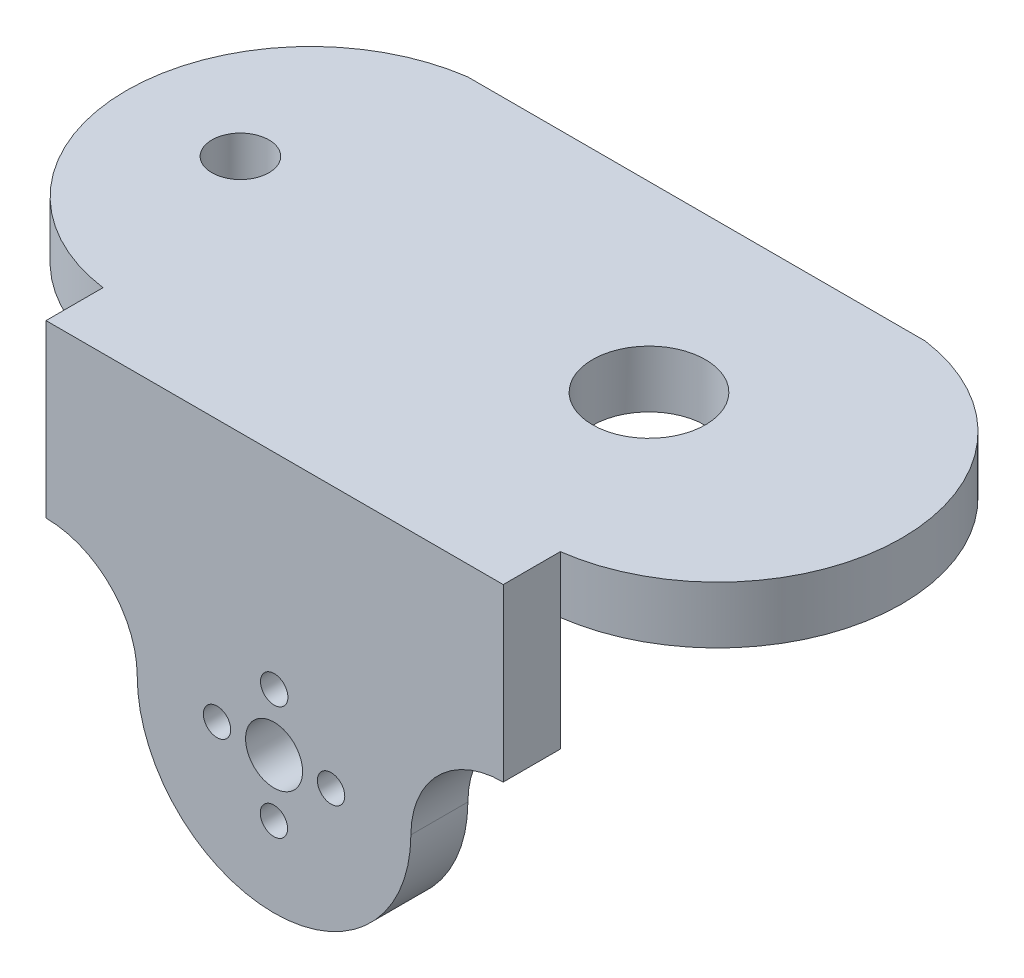
ISO-10303-21;
HEADER;
FILE_DESCRIPTION(('STEP AP214'),'2;1');
FILE_NAME('part.step','',(''),(''),'','','');
FILE_SCHEMA(('AUTOMOTIVE_DESIGN { 1 0 10303 214 1 1 1 1 }'));
ENDSEC;
DATA;
#1=APPLICATION_CONTEXT('core data for automotive mechanical design processes');
#2=APPLICATION_PROTOCOL_DEFINITION('international standard','automotive_design',2000,#1);
#3=PRODUCT_CONTEXT('',#1,'mechanical');
#4=PRODUCT('Part','Part','',(#3));
#5=PRODUCT_RELATED_PRODUCT_CATEGORY('part','',(#4));
#6=PRODUCT_DEFINITION_FORMATION('','',#4);
#7=PRODUCT_DEFINITION_CONTEXT('part definition',#1,'design');
#8=PRODUCT_DEFINITION('design','',#6,#7);
#9=PRODUCT_DEFINITION_SHAPE('','',#8);
#10=(LENGTH_UNIT() NAMED_UNIT(*) SI_UNIT(.MILLI.,.METRE.));
#11=(NAMED_UNIT(*) PLANE_ANGLE_UNIT() SI_UNIT($,.RADIAN.));
#12=(NAMED_UNIT(*) SI_UNIT($,.STERADIAN.) SOLID_ANGLE_UNIT());
#13=UNCERTAINTY_MEASURE_WITH_UNIT(LENGTH_MEASURE(1.E-05),#10,'distance_accuracy_value','');
#14=(GEOMETRIC_REPRESENTATION_CONTEXT(3) GLOBAL_UNCERTAINTY_ASSIGNED_CONTEXT((#13)) GLOBAL_UNIT_ASSIGNED_CONTEXT((#10,
#11,#12)) REPRESENTATION_CONTEXT('',''));
#15=CARTESIAN_POINT('',(0.,0.,0.));
#16=DIRECTION('',(0.,0.,1.));
#17=DIRECTION('',(1.,0.,0.));
#18=AXIS2_PLACEMENT_3D('',#15,#16,#17);
#19=CARTESIAN_POINT('',(40.1,0.,5.));
#20=DIRECTION('',(1.,0.,0.));
#21=DIRECTION('',(0.,0.,-1.));
#22=AXIS2_PLACEMENT_3D('',#19,#20,#21);
#23=PLANE('',#22);
#24=DIRECTION('',(0.,1.,0.));
#25=VECTOR('',#24,1.);
#26=CARTESIAN_POINT('',(40.1,-34.9084875066222,0.));
#27=LINE('',#26,#25);
#28=CARTESIAN_POINT('',(40.1,0.,0.));
#29=VERTEX_POINT('',#28);
#30=CARTESIAN_POINT('',(40.1,5.,0.));
#31=VERTEX_POINT('',#30);
#32=EDGE_CURVE('E56',#29,#31,#27,.T.);
#33=ORIENTED_EDGE('',*,*,#32,.T.);
#34=DIRECTION('',(0.,0.,1.));
#35=VECTOR('',#34,1.);
#36=CARTESIAN_POINT('',(40.1,5.,-32.));
#37=LINE('',#36,#35);
#38=CARTESIAN_POINT('',(40.1,5.,5.));
#39=VERTEX_POINT('',#38);
#40=EDGE_CURVE('E122',#31,#39,#37,.T.);
#41=ORIENTED_EDGE('',*,*,#40,.T.);
#42=DIRECTION('',(0.,-1.,0.));
#43=VECTOR('',#42,1.);
#44=CARTESIAN_POINT('',(40.1,0.,5.));
#45=LINE('',#44,#43);
#46=CARTESIAN_POINT('',(40.1,-10.,5.));
#47=VERTEX_POINT('',#46);
#48=EDGE_CURVE('E159',#39,#47,#45,.T.);
#49=ORIENTED_EDGE('',*,*,#48,.T.);
#50=DIRECTION('',(0.,0.,-1.));
#51=VECTOR('',#50,1.);
#52=CARTESIAN_POINT('',(40.1,-10.,5.));
#53=LINE('',#52,#51);
#54=CARTESIAN_POINT('',(40.1,-10.,0.));
#55=VERTEX_POINT('',#54);
#56=EDGE_CURVE('E171',#47,#55,#53,.T.);
#57=ORIENTED_EDGE('',*,*,#56,.T.);
#58=DIRECTION('',(0.,-1.,0.));
#59=VECTOR('',#58,1.);
#60=CARTESIAN_POINT('',(40.1,0.,0.));
#61=LINE('',#60,#59);
#62=EDGE_CURVE('E157',#29,#55,#61,.T.);
#63=ORIENTED_EDGE('',*,*,#62,.F.);
#64=EDGE_LOOP('',(#33,#41,#49,#57,#63));
#65=FACE_BOUND('',#64,.T.);
#66=ADVANCED_FACE('F40',(#65),#23,.T.);
#67=CARTESIAN_POINT('',(0.,0.,5.));
#68=DIRECTION('',(1.,0.,0.));
#69=DIRECTION('',(0.,1.,0.));
#70=AXIS2_PLACEMENT_3D('',#67,#68,#69);
#71=PLANE('',#70);
#72=DIRECTION('',(0.,0.,1.));
#73=VECTOR('',#72,1.);
#74=CARTESIAN_POINT('',(0.,5.,-32.));
#75=LINE('',#74,#73);
#76=CARTESIAN_POINT('',(0.,5.,0.));
#77=VERTEX_POINT('',#76);
#78=CARTESIAN_POINT('',(0.,5.,5.));
#79=VERTEX_POINT('',#78);
#80=EDGE_CURVE('E64',#77,#79,#75,.T.);
#81=ORIENTED_EDGE('',*,*,#80,.F.);
#82=DIRECTION('',(0.,1.,0.));
#83=VECTOR('',#82,1.);
#84=CARTESIAN_POINT('',(0.,-34.9084875066222,0.));
#85=LINE('',#84,#83);
#86=CARTESIAN_POINT('',(0.,0.,0.));
#87=VERTEX_POINT('',#86);
#88=EDGE_CURVE('E149',#87,#77,#85,.T.);
#89=ORIENTED_EDGE('',*,*,#88,.F.);
#90=DIRECTION('',(0.,-1.,0.));
#91=VECTOR('',#90,1.);
#92=CARTESIAN_POINT('',(0.,0.,0.));
#93=LINE('',#92,#91);
#94=CARTESIAN_POINT('',(0.,-10.,0.));
#95=VERTEX_POINT('',#94);
#96=EDGE_CURVE('E177',#87,#95,#93,.T.);
#97=ORIENTED_EDGE('',*,*,#96,.T.);
#98=DIRECTION('',(0.,0.,-1.));
#99=VECTOR('',#98,1.);
#100=CARTESIAN_POINT('',(0.,-10.,5.));
#101=LINE('',#100,#99);
#102=CARTESIAN_POINT('',(0.,-10.,5.));
#103=VERTEX_POINT('',#102);
#104=EDGE_CURVE('E11',#103,#95,#101,.T.);
#105=ORIENTED_EDGE('',*,*,#104,.F.);
#106=DIRECTION('',(0.,-1.,0.));
#107=VECTOR('',#106,1.);
#108=CARTESIAN_POINT('',(0.,0.,5.));
#109=LINE('',#108,#107);
#110=EDGE_CURVE('E162',#79,#103,#109,.T.);
#111=ORIENTED_EDGE('',*,*,#110,.F.);
#112=EDGE_LOOP('',(#81,#89,#97,#105,#111));
#113=FACE_BOUND('',#112,.T.);
#114=ADVANCED_FACE('F225',(#113),#71,.F.);
#115=CARTESIAN_POINT('',(0.,-18.,5.));
#116=DIRECTION('',(0.,0.,-1.));
#117=DIRECTION('',(-1.,0.,0.));
#118=AXIS2_PLACEMENT_3D('',#115,#116,#117);
#119=CYLINDRICAL_SURFACE('',#118,8.);
#120=CARTESIAN_POINT('',(0.,-18.,0.));
#121=DIRECTION('',(0.,0.,1.));
#122=DIRECTION('',(1.,0.,0.));
#123=AXIS2_PLACEMENT_3D('',#120,#121,#122);
#124=CIRCLE('',#123,8.);
#125=CARTESIAN_POINT('',(8.,-18.,0.));
#126=VERTEX_POINT('',#125);
#127=EDGE_CURVE('E179',#95,#126,#124,.F.);
#128=ORIENTED_EDGE('',*,*,#127,.T.);
#129=DIRECTION('',(0.,0.,-1.));
#130=VECTOR('',#129,1.);
#131=CARTESIAN_POINT('',(8.,-18.,5.));
#132=LINE('',#131,#130);
#133=CARTESIAN_POINT('',(8.,-18.,5.));
#134=VERTEX_POINT('',#133);
#135=EDGE_CURVE('E48',#134,#126,#132,.T.);
#136=ORIENTED_EDGE('',*,*,#135,.F.);
#137=CARTESIAN_POINT('',(0.,-18.,5.));
#138=DIRECTION('',(0.,0.,1.));
#139=DIRECTION('',(1.,0.,0.));
#140=AXIS2_PLACEMENT_3D('',#137,#138,#139);
#141=CIRCLE('',#140,8.);
#142=EDGE_CURVE('E165',#103,#134,#141,.F.);
#143=ORIENTED_EDGE('',*,*,#142,.F.);
#144=ORIENTED_EDGE('',*,*,#104,.T.);
#145=EDGE_LOOP('',(#128,#136,#143,#144));
#146=FACE_BOUND('',#145,.T.);
#147=ADVANCED_FACE('F230',(#146),#119,.F.);
#148=CARTESIAN_POINT('',(20.,-18.,5.));
#149=DIRECTION('',(0.,0.,-1.));
#150=DIRECTION('',(-1.,0.,0.));
#151=AXIS2_PLACEMENT_3D('',#148,#149,#150);
#152=CYLINDRICAL_SURFACE('',#151,12.);
#153=CARTESIAN_POINT('',(20.,-18.,0.));
#154=DIRECTION('',(0.,0.,1.));
#155=DIRECTION('',(1.,0.,0.));
#156=AXIS2_PLACEMENT_3D('',#153,#154,#155);
#157=CIRCLE('',#156,12.);
#158=CARTESIAN_POINT('',(31.999850748125,-18.0598500018656,0.));
#159=VERTEX_POINT('',#158);
#160=EDGE_CURVE('E181',#126,#159,#157,.T.);
#161=ORIENTED_EDGE('',*,*,#160,.T.);
#162=DIRECTION('',(0.,0.,-1.));
#163=VECTOR('',#162,1.);
#164=CARTESIAN_POINT('',(31.999850748125,-18.0598500018656,5.));
#165=LINE('',#164,#163);
#166=CARTESIAN_POINT('',(31.999850748125,-18.0598500018656,5.));
#167=VERTEX_POINT('',#166);
#168=EDGE_CURVE('E186',#167,#159,#165,.T.);
#169=ORIENTED_EDGE('',*,*,#168,.F.);
#170=CARTESIAN_POINT('',(20.,-18.,5.));
#171=DIRECTION('',(0.,0.,1.));
#172=DIRECTION('',(1.,0.,0.));
#173=AXIS2_PLACEMENT_3D('',#170,#171,#172);
#174=CIRCLE('',#173,12.);
#175=EDGE_CURVE('E167',#134,#167,#174,.T.);
#176=ORIENTED_EDGE('',*,*,#175,.F.);
#177=ORIENTED_EDGE('',*,*,#135,.T.);
#178=EDGE_LOOP('',(#161,#169,#176,#177));
#179=FACE_BOUND('',#178,.T.);
#180=ADVANCED_FACE('F235',(#179),#152,.T.);
#181=CARTESIAN_POINT('',(40.1,-18.10025,5.));
#182=DIRECTION('',(0.,0.,-1.));
#183=DIRECTION('',(-1.,0.,0.));
#184=AXIS2_PLACEMENT_3D('',#181,#182,#183);
#185=CYLINDRICAL_SURFACE('',#184,8.10025);
#186=CARTESIAN_POINT('',(40.1,-18.10025,0.));
#187=DIRECTION('',(0.,0.,1.));
#188=DIRECTION('',(1.,0.,0.));
#189=AXIS2_PLACEMENT_3D('',#186,#187,#188);
#190=CIRCLE('',#189,8.10025);
#191=EDGE_CURVE('E163',#159,#55,#190,.F.);
#192=ORIENTED_EDGE('',*,*,#191,.T.);
#193=ORIENTED_EDGE('',*,*,#56,.F.);
#194=CARTESIAN_POINT('',(40.1,-18.10025,5.));
#195=DIRECTION('',(0.,0.,1.));
#196=DIRECTION('',(1.,0.,0.));
#197=AXIS2_PLACEMENT_3D('',#194,#195,#196);
#198=CIRCLE('',#197,8.10025);
#199=EDGE_CURVE('E169',#167,#47,#198,.F.);
#200=ORIENTED_EDGE('',*,*,#199,.F.);
#201=ORIENTED_EDGE('',*,*,#168,.T.);
#202=EDGE_LOOP('',(#192,#193,#200,#201));
#203=FACE_BOUND('',#202,.T.);
#204=ADVANCED_FACE('F241',(#203),#185,.F.);
#205=CARTESIAN_POINT('',(0.,0.,5.));
#206=DIRECTION('',(0.,0.,1.));
#207=DIRECTION('',(1.,0.,0.));
#208=AXIS2_PLACEMENT_3D('',#205,#206,#207);
#209=PLANE('',#208);
#210=CARTESIAN_POINT('',(20.0124688279302,-13.,5.));
#211=DIRECTION('',(0.,0.,1.));
#212=DIRECTION('',(1.,0.,0.));
#213=AXIS2_PLACEMENT_3D('',#210,#211,#212);
#214=CIRCLE('',#213,1.2);
#215=CARTESIAN_POINT('',(21.2124688279302,-13.,5.));
#216=VERTEX_POINT('',#215);
#217=EDGE_CURVE('E195',#216,#216,#214,.T.);
#218=ORIENTED_EDGE('',*,*,#217,.F.);
#219=EDGE_LOOP('',(#218));
#220=FACE_BOUND('',#219,.T.);
#221=CARTESIAN_POINT('',(25.,-18.0249378109453,5.));
#222=DIRECTION('',(0.,0.,1.));
#223=DIRECTION('',(1.,0.,0.));
#224=AXIS2_PLACEMENT_3D('',#221,#222,#223);
#225=CIRCLE('',#224,1.2);
#226=CARTESIAN_POINT('',(26.2,-18.0249378109453,5.));
#227=VERTEX_POINT('',#226);
#228=EDGE_CURVE('E303',#227,#227,#225,.T.);
#229=ORIENTED_EDGE('',*,*,#228,.F.);
#230=EDGE_LOOP('',(#229));
#231=FACE_BOUND('',#230,.T.);
#232=CARTESIAN_POINT('',(19.9875311720698,-23.,5.));
#233=DIRECTION('',(0.,0.,1.));
#234=DIRECTION('',(1.,0.,0.));
#235=AXIS2_PLACEMENT_3D('',#232,#233,#234);
#236=CIRCLE('',#235,1.2);
#237=CARTESIAN_POINT('',(21.1875311720698,-23.,5.));
#238=VERTEX_POINT('',#237);
#239=EDGE_CURVE('E301',#238,#238,#236,.T.);
#240=ORIENTED_EDGE('',*,*,#239,.F.);
#241=EDGE_LOOP('',(#240));
#242=FACE_BOUND('',#241,.T.);
#243=CARTESIAN_POINT('',(15.,-17.9750621890547,5.));
#244=DIRECTION('',(0.,0.,1.));
#245=DIRECTION('',(1.,0.,0.));
#246=AXIS2_PLACEMENT_3D('',#243,#244,#245);
#247=CIRCLE('',#246,1.2);
#248=CARTESIAN_POINT('',(16.2,-17.9750621890547,5.));
#249=VERTEX_POINT('',#248);
#250=EDGE_CURVE('E141',#249,#249,#247,.T.);
#251=ORIENTED_EDGE('',*,*,#250,.F.);
#252=EDGE_LOOP('',(#251));
#253=FACE_BOUND('',#252,.T.);
#254=CARTESIAN_POINT('',(20.,-18.,5.));
#255=DIRECTION('',(0.,0.,1.));
#256=DIRECTION('',(1.,0.,0.));
#257=AXIS2_PLACEMENT_3D('',#254,#255,#256);
#258=CIRCLE('',#257,2.5);
#259=CARTESIAN_POINT('',(22.5,-18.,5.));
#260=VERTEX_POINT('',#259);
#261=EDGE_CURVE('E277',#260,#260,#258,.T.);
#262=ORIENTED_EDGE('',*,*,#261,.F.);
#263=EDGE_LOOP('',(#262));
#264=FACE_BOUND('',#263,.T.);
#265=ORIENTED_EDGE('',*,*,#48,.F.);
#266=DIRECTION('',(-1.,0.,0.));
#267=VECTOR('',#266,1.);
#268=CARTESIAN_POINT('',(0.,5.,5.));
#269=LINE('',#268,#267);
#270=EDGE_CURVE('E151',#39,#79,#269,.T.);
#271=ORIENTED_EDGE('',*,*,#270,.T.);
#272=ORIENTED_EDGE('',*,*,#110,.T.);
#273=ORIENTED_EDGE('',*,*,#142,.T.);
#274=ORIENTED_EDGE('',*,*,#175,.T.);
#275=ORIENTED_EDGE('',*,*,#199,.T.);
#276=EDGE_LOOP('',(#265,#271,#272,#273,#274,#275));
#277=FACE_BOUND('',#276,.T.);
#278=ADVANCED_FACE('F245',(#220,#231,#242,#253,#264,#277),#209,.T.);
#279=CARTESIAN_POINT('',(0.,0.,0.));
#280=DIRECTION('',(0.,0.,1.));
#281=DIRECTION('',(1.,0.,0.));
#282=AXIS2_PLACEMENT_3D('',#279,#280,#281);
#283=PLANE('',#282);
#284=CARTESIAN_POINT('',(20.0124688279302,-13.,0.));
#285=DIRECTION('',(0.,0.,1.));
#286=DIRECTION('',(1.,0.,0.));
#287=AXIS2_PLACEMENT_3D('',#284,#285,#286);
#288=CIRCLE('',#287,1.2);
#289=CARTESIAN_POINT('',(21.2124688279302,-13.,0.));
#290=VERTEX_POINT('',#289);
#291=EDGE_CURVE('E43',#290,#290,#288,.T.);
#292=ORIENTED_EDGE('',*,*,#291,.T.);
#293=EDGE_LOOP('',(#292));
#294=FACE_BOUND('',#293,.T.);
#295=CARTESIAN_POINT('',(25.,-18.0249378109453,0.));
#296=DIRECTION('',(0.,0.,1.));
#297=DIRECTION('',(1.,0.,0.));
#298=AXIS2_PLACEMENT_3D('',#295,#296,#297);
#299=CIRCLE('',#298,1.2);
#300=CARTESIAN_POINT('',(26.2,-18.0249378109453,0.));
#301=VERTEX_POINT('',#300);
#302=EDGE_CURVE('E138',#301,#301,#299,.T.);
#303=ORIENTED_EDGE('',*,*,#302,.T.);
#304=EDGE_LOOP('',(#303));
#305=FACE_BOUND('',#304,.T.);
#306=CARTESIAN_POINT('',(19.9875311720698,-23.,0.));
#307=DIRECTION('',(0.,0.,1.));
#308=DIRECTION('',(1.,0.,0.));
#309=AXIS2_PLACEMENT_3D('',#306,#307,#308);
#310=CIRCLE('',#309,1.2);
#311=CARTESIAN_POINT('',(21.1875311720698,-23.,0.));
#312=VERTEX_POINT('',#311);
#313=EDGE_CURVE('E198',#312,#312,#310,.T.);
#314=ORIENTED_EDGE('',*,*,#313,.T.);
#315=EDGE_LOOP('',(#314));
#316=FACE_BOUND('',#315,.T.);
#317=CARTESIAN_POINT('',(15.,-17.9750621890547,0.));
#318=DIRECTION('',(0.,0.,1.));
#319=DIRECTION('',(1.,0.,0.));
#320=AXIS2_PLACEMENT_3D('',#317,#318,#319);
#321=CIRCLE('',#320,1.2);
#322=CARTESIAN_POINT('',(16.2,-17.9750621890547,0.));
#323=VERTEX_POINT('',#322);
#324=EDGE_CURVE('E194',#323,#323,#321,.T.);
#325=ORIENTED_EDGE('',*,*,#324,.T.);
#326=EDGE_LOOP('',(#325));
#327=FACE_BOUND('',#326,.T.);
#328=CARTESIAN_POINT('',(20.,-18.,0.));
#329=DIRECTION('',(0.,0.,1.));
#330=DIRECTION('',(1.,0.,0.));
#331=AXIS2_PLACEMENT_3D('',#328,#329,#330);
#332=CIRCLE('',#331,2.5);
#333=CARTESIAN_POINT('',(22.5,-18.,0.));
#334=VERTEX_POINT('',#333);
#335=EDGE_CURVE('E191',#334,#334,#332,.T.);
#336=ORIENTED_EDGE('',*,*,#335,.T.);
#337=EDGE_LOOP('',(#336));
#338=FACE_BOUND('',#337,.T.);
#339=ORIENTED_EDGE('',*,*,#62,.T.);
#340=ORIENTED_EDGE('',*,*,#191,.F.);
#341=ORIENTED_EDGE('',*,*,#160,.F.);
#342=ORIENTED_EDGE('',*,*,#127,.F.);
#343=ORIENTED_EDGE('',*,*,#96,.F.);
#344=DIRECTION('',(1.,0.,0.));
#345=VECTOR('',#344,1.);
#346=CARTESIAN_POINT('',(0.,0.,0.));
#347=LINE('',#346,#345);
#348=EDGE_CURVE('E174',#87,#29,#347,.T.);
#349=ORIENTED_EDGE('',*,*,#348,.T.);
#350=EDGE_LOOP('',(#339,#340,#341,#342,#343,#349));
#351=FACE_BOUND('',#350,.T.);
#352=ADVANCED_FACE('F203',(#294,#305,#316,#327,#338,#351),#283,.F.);
#353=CARTESIAN_POINT('',(0.,0.,-32.));
#354=DIRECTION('',(0.,-1.,0.));
#355=DIRECTION('',(0.,0.,-1.));
#356=AXIS2_PLACEMENT_3D('',#353,#354,#355);
#357=PLANE('',#356);
#358=CARTESIAN_POINT('',(31.88,0.,-16.));
#359=DIRECTION('',(0.,-1.,0.));
#360=DIRECTION('',(0.,0.,-1.));
#361=AXIS2_PLACEMENT_3D('',#358,#359,#360);
#362=CIRCLE('',#361,4.95499999999998);
#363=CARTESIAN_POINT('',(31.88,0.,-20.955));
#364=VERTEX_POINT('',#363);
#365=EDGE_CURVE('E305',#364,#364,#362,.T.);
#366=ORIENTED_EDGE('',*,*,#365,.F.);
#367=EDGE_LOOP('',(#366));
#368=FACE_BOUND('',#367,.T.);
#369=CARTESIAN_POINT('',(-3.95,0.,-16.));
#370=DIRECTION('',(0.,-1.,0.));
#371=DIRECTION('',(0.,0.,-1.));
#372=AXIS2_PLACEMENT_3D('',#369,#370,#371);
#373=CIRCLE('',#372,2.5);
#374=CARTESIAN_POINT('',(-3.95,0.,-18.5));
#375=VERTEX_POINT('',#374);
#376=EDGE_CURVE('E310',#375,#375,#373,.T.);
#377=ORIENTED_EDGE('',*,*,#376,.F.);
#378=EDGE_LOOP('',(#377));
#379=FACE_BOUND('',#378,.T.);
#380=ORIENTED_EDGE('',*,*,#348,.F.);
#381=CARTESIAN_POINT('',(2.20062724014337,0.,-16.));
#382=DIRECTION('',(0.,-1.,0.));
#383=DIRECTION('',(0.,0.,-1.));
#384=AXIS2_PLACEMENT_3D('',#381,#382,#383);
#385=CIRCLE('',#384,16.1506272401434);
#386=CARTESIAN_POINT('',(0.,0.,-32.));
#387=VERTEX_POINT('',#386);
#388=EDGE_CURVE('E146',#387,#87,#385,.F.);
#389=ORIENTED_EDGE('',*,*,#388,.F.);
#390=DIRECTION('',(1.,0.,0.));
#391=VECTOR('',#390,1.);
#392=CARTESIAN_POINT('',(0.,0.,-32.));
#393=LINE('',#392,#391);
#394=CARTESIAN_POINT('',(40.1,0.,-32.));
#395=VERTEX_POINT('',#394);
#396=EDGE_CURVE('E131',#387,#395,#393,.T.);
#397=ORIENTED_EDGE('',*,*,#396,.T.);
#398=CARTESIAN_POINT('',(37.8993727598566,0.,-16.));
#399=DIRECTION('',(0.,-1.,0.));
#400=DIRECTION('',(0.,0.,-1.));
#401=AXIS2_PLACEMENT_3D('',#398,#399,#400);
#402=CIRCLE('',#401,16.1506272401434);
#403=EDGE_CURVE('E130',#29,#395,#402,.F.);
#404=ORIENTED_EDGE('',*,*,#403,.F.);
#405=EDGE_LOOP('',(#380,#389,#397,#404));
#406=FACE_BOUND('',#405,.T.);
#407=ADVANCED_FACE('F249',(#368,#379,#406),#357,.T.);
#408=CARTESIAN_POINT('',(0.,5.,-32.));
#409=DIRECTION('',(0.,1.,0.));
#410=DIRECTION('',(0.,0.,1.));
#411=AXIS2_PLACEMENT_3D('',#408,#409,#410);
#412=PLANE('',#411);
#413=CARTESIAN_POINT('',(31.88,5.,-16.));
#414=DIRECTION('',(0.,1.,0.));
#415=DIRECTION('',(0.,0.,1.));
#416=AXIS2_PLACEMENT_3D('',#413,#414,#415);
#417=CIRCLE('',#416,4.95499999999998);
#418=CARTESIAN_POINT('',(31.88,5.,-11.045));
#419=VERTEX_POINT('',#418);
#420=EDGE_CURVE('E313',#419,#419,#417,.T.);
#421=ORIENTED_EDGE('',*,*,#420,.F.);
#422=EDGE_LOOP('',(#421));
#423=FACE_BOUND('',#422,.T.);
#424=CARTESIAN_POINT('',(-3.95,5.,-16.));
#425=DIRECTION('',(0.,1.,0.));
#426=DIRECTION('',(0.,0.,1.));
#427=AXIS2_PLACEMENT_3D('',#424,#425,#426);
#428=CIRCLE('',#427,2.5);
#429=CARTESIAN_POINT('',(-3.95,5.,-13.5));
#430=VERTEX_POINT('',#429);
#431=EDGE_CURVE('E314',#430,#430,#428,.T.);
#432=ORIENTED_EDGE('',*,*,#431,.F.);
#433=EDGE_LOOP('',(#432));
#434=FACE_BOUND('',#433,.T.);
#435=ORIENTED_EDGE('',*,*,#270,.F.);
#436=ORIENTED_EDGE('',*,*,#40,.F.);
#437=CARTESIAN_POINT('',(37.8993727598566,5.,-16.));
#438=DIRECTION('',(0.,1.,0.));
#439=DIRECTION('',(0.,0.,1.));
#440=AXIS2_PLACEMENT_3D('',#437,#438,#439);
#441=CIRCLE('',#440,16.1506272401434);
#442=CARTESIAN_POINT('',(40.1,5.,-32.));
#443=VERTEX_POINT('',#442);
#444=EDGE_CURVE('E128',#31,#443,#441,.T.);
#445=ORIENTED_EDGE('',*,*,#444,.T.);
#446=DIRECTION('',(-1.,0.,0.));
#447=VECTOR('',#446,1.);
#448=CARTESIAN_POINT('',(0.,5.,-32.));
#449=LINE('',#448,#447);
#450=CARTESIAN_POINT('',(0.,5.,-32.));
#451=VERTEX_POINT('',#450);
#452=EDGE_CURVE('E111',#443,#451,#449,.T.);
#453=ORIENTED_EDGE('',*,*,#452,.T.);
#454=CARTESIAN_POINT('',(2.20062724014337,5.,-16.));
#455=DIRECTION('',(0.,1.,0.));
#456=DIRECTION('',(0.,0.,-1.));
#457=AXIS2_PLACEMENT_3D('',#454,#455,#456);
#458=CIRCLE('',#457,16.1506272401434);
#459=EDGE_CURVE('E143',#451,#77,#458,.T.);
#460=ORIENTED_EDGE('',*,*,#459,.T.);
#461=ORIENTED_EDGE('',*,*,#80,.T.);
#462=EDGE_LOOP('',(#435,#436,#445,#453,#460,#461));
#463=FACE_BOUND('',#462,.T.);
#464=ADVANCED_FACE('F134',(#423,#434,#463),#412,.T.);
#465=CARTESIAN_POINT('',(0.,0.,-32.));
#466=DIRECTION('',(0.,0.,-1.));
#467=DIRECTION('',(-1.,0.,0.));
#468=AXIS2_PLACEMENT_3D('',#465,#466,#467);
#469=PLANE('',#468);
#470=DIRECTION('',(0.,-1.,0.));
#471=VECTOR('',#470,1.);
#472=CARTESIAN_POINT('',(0.,0.,-32.));
#473=LINE('',#472,#471);
#474=EDGE_CURVE('E117',#451,#387,#473,.T.);
#475=ORIENTED_EDGE('',*,*,#474,.F.);
#476=ORIENTED_EDGE('',*,*,#452,.F.);
#477=DIRECTION('',(0.,1.,0.));
#478=VECTOR('',#477,1.);
#479=CARTESIAN_POINT('',(40.1,0.,-32.));
#480=LINE('',#479,#478);
#481=EDGE_CURVE('E114',#395,#443,#480,.T.);
#482=ORIENTED_EDGE('',*,*,#481,.F.);
#483=ORIENTED_EDGE('',*,*,#396,.F.);
#484=EDGE_LOOP('',(#475,#476,#482,#483));
#485=FACE_BOUND('',#484,.T.);
#486=ADVANCED_FACE('F113',(#485),#469,.T.);
#487=CARTESIAN_POINT('',(2.20062724014337,-34.9084875066222,-16.));
#488=DIRECTION('',(0.,1.,0.));
#489=DIRECTION('',(0.,0.,1.));
#490=AXIS2_PLACEMENT_3D('',#487,#488,#489);
#491=CYLINDRICAL_SURFACE('',#490,16.1506272401434);
#492=ORIENTED_EDGE('',*,*,#474,.T.);
#493=ORIENTED_EDGE('',*,*,#388,.T.);
#494=ORIENTED_EDGE('',*,*,#88,.T.);
#495=ORIENTED_EDGE('',*,*,#459,.F.);
#496=EDGE_LOOP('',(#492,#493,#494,#495));
#497=FACE_BOUND('',#496,.T.);
#498=ADVANCED_FACE('F261',(#497),#491,.T.);
#499=CARTESIAN_POINT('',(37.8993727598566,-34.9084875066222,-16.));
#500=DIRECTION('',(0.,1.,0.));
#501=DIRECTION('',(0.,0.,1.));
#502=AXIS2_PLACEMENT_3D('',#499,#500,#501);
#503=CYLINDRICAL_SURFACE('',#502,16.1506272401434);
#504=ORIENTED_EDGE('',*,*,#32,.F.);
#505=ORIENTED_EDGE('',*,*,#403,.T.);
#506=ORIENTED_EDGE('',*,*,#481,.T.);
#507=ORIENTED_EDGE('',*,*,#444,.F.);
#508=EDGE_LOOP('',(#504,#505,#506,#507));
#509=FACE_BOUND('',#508,.T.);
#510=ADVANCED_FACE('F127',(#509),#503,.T.);
#511=CARTESIAN_POINT('',(20.,-18.,-32.));
#512=DIRECTION('',(0.,0.,1.));
#513=DIRECTION('',(1.,0.,0.));
#514=AXIS2_PLACEMENT_3D('',#511,#512,#513);
#515=CYLINDRICAL_SURFACE('',#514,2.5);
#516=ORIENTED_EDGE('',*,*,#261,.T.);
#517=EDGE_LOOP('',(#516));
#518=FACE_BOUND('',#517,.T.);
#519=ORIENTED_EDGE('',*,*,#335,.F.);
#520=EDGE_LOOP('',(#519));
#521=FACE_BOUND('',#520,.T.);
#522=ADVANCED_FACE('F267',(#518,#521),#515,.F.);
#523=CARTESIAN_POINT('',(15.,-17.9750621890547,-32.));
#524=DIRECTION('',(0.,0.,1.));
#525=DIRECTION('',(1.,0.,0.));
#526=AXIS2_PLACEMENT_3D('',#523,#524,#525);
#527=CYLINDRICAL_SURFACE('',#526,1.2);
#528=ORIENTED_EDGE('',*,*,#250,.T.);
#529=EDGE_LOOP('',(#528));
#530=FACE_BOUND('',#529,.T.);
#531=ORIENTED_EDGE('',*,*,#324,.F.);
#532=EDGE_LOOP('',(#531));
#533=FACE_BOUND('',#532,.T.);
#534=ADVANCED_FACE('F219',(#530,#533),#527,.F.);
#535=CARTESIAN_POINT('',(19.9875311720698,-23.,-32.));
#536=DIRECTION('',(0.,0.,1.));
#537=DIRECTION('',(1.,0.,0.));
#538=AXIS2_PLACEMENT_3D('',#535,#536,#537);
#539=CYLINDRICAL_SURFACE('',#538,1.2);
#540=ORIENTED_EDGE('',*,*,#239,.T.);
#541=EDGE_LOOP('',(#540));
#542=FACE_BOUND('',#541,.T.);
#543=ORIENTED_EDGE('',*,*,#313,.F.);
#544=EDGE_LOOP('',(#543));
#545=FACE_BOUND('',#544,.T.);
#546=ADVANCED_FACE('F209',(#542,#545),#539,.F.);
#547=CARTESIAN_POINT('',(25.,-18.0249378109453,-32.));
#548=DIRECTION('',(0.,0.,1.));
#549=DIRECTION('',(1.,0.,0.));
#550=AXIS2_PLACEMENT_3D('',#547,#548,#549);
#551=CYLINDRICAL_SURFACE('',#550,1.2);
#552=ORIENTED_EDGE('',*,*,#228,.T.);
#553=EDGE_LOOP('',(#552));
#554=FACE_BOUND('',#553,.T.);
#555=ORIENTED_EDGE('',*,*,#302,.F.);
#556=EDGE_LOOP('',(#555));
#557=FACE_BOUND('',#556,.T.);
#558=ADVANCED_FACE('F206',(#554,#557),#551,.F.);
#559=CARTESIAN_POINT('',(20.0124688279302,-13.,-32.));
#560=DIRECTION('',(0.,0.,1.));
#561=DIRECTION('',(1.,0.,0.));
#562=AXIS2_PLACEMENT_3D('',#559,#560,#561);
#563=CYLINDRICAL_SURFACE('',#562,1.2);
#564=ORIENTED_EDGE('',*,*,#217,.T.);
#565=EDGE_LOOP('',(#564));
#566=FACE_BOUND('',#565,.T.);
#567=ORIENTED_EDGE('',*,*,#291,.F.);
#568=EDGE_LOOP('',(#567));
#569=FACE_BOUND('',#568,.T.);
#570=ADVANCED_FACE('F208',(#566,#569),#563,.F.);
#571=CARTESIAN_POINT('',(-3.95,-30.,-16.));
#572=DIRECTION('',(0.,1.,0.));
#573=DIRECTION('',(0.,0.,1.));
#574=AXIS2_PLACEMENT_3D('',#571,#572,#573);
#575=CYLINDRICAL_SURFACE('',#574,2.5);
#576=ORIENTED_EDGE('',*,*,#376,.T.);
#577=EDGE_LOOP('',(#576));
#578=FACE_BOUND('',#577,.T.);
#579=ORIENTED_EDGE('',*,*,#431,.T.);
#580=EDGE_LOOP('',(#579));
#581=FACE_BOUND('',#580,.T.);
#582=ADVANCED_FACE('F216',(#578,#581),#575,.F.);
#583=CARTESIAN_POINT('',(31.88,-30.,-16.));
#584=DIRECTION('',(0.,1.,0.));
#585=DIRECTION('',(0.,0.,1.));
#586=AXIS2_PLACEMENT_3D('',#583,#584,#585);
#587=CYLINDRICAL_SURFACE('',#586,4.95499999999998);
#588=ORIENTED_EDGE('',*,*,#365,.T.);
#589=EDGE_LOOP('',(#588));
#590=FACE_BOUND('',#589,.T.);
#591=ORIENTED_EDGE('',*,*,#420,.T.);
#592=EDGE_LOOP('',(#591));
#593=FACE_BOUND('',#592,.T.);
#594=ADVANCED_FACE('F320',(#590,#593),#587,.F.);
#595=CLOSED_SHELL('',(#66,#114,#147,#180,#204,#278,#352,#407,#464,#486,#498,#510,#522,#534,#546,
#558,#570,#582,#594));
#596=MANIFOLD_SOLID_BREP('B2',#595);
#597=ADVANCED_BREP_SHAPE_REPRESENTATION('',(#18,#596),#14);
#598=SHAPE_DEFINITION_REPRESENTATION(#9,#597);
ENDSEC;
END-ISO-10303-21;
